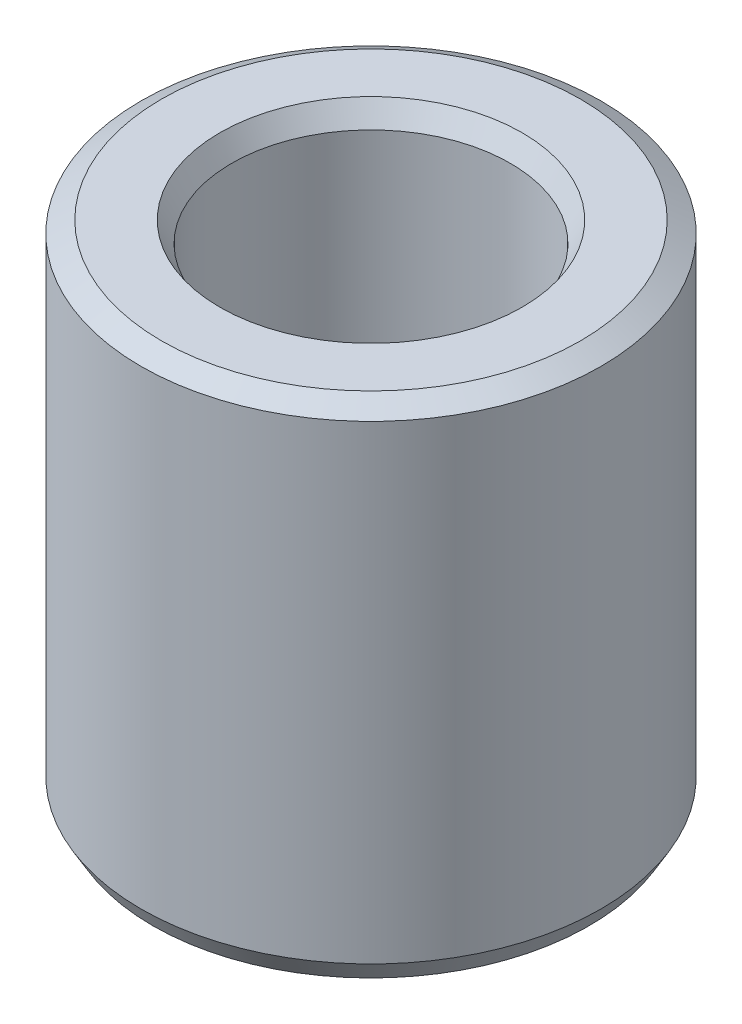
ISO-10303-21;
HEADER;
FILE_DESCRIPTION(('STEP AP214'),'2;1');
FILE_NAME('part.step','',(''),(''),'','','');
FILE_SCHEMA(('AUTOMOTIVE_DESIGN { 1 0 10303 214 1 1 1 1 }'));
ENDSEC;
DATA;
#1=APPLICATION_CONTEXT('core data for automotive mechanical design processes');
#2=APPLICATION_PROTOCOL_DEFINITION('international standard','automotive_design',2000,#1);
#3=PRODUCT_CONTEXT('',#1,'mechanical');
#4=PRODUCT('Part','Part','',(#3));
#5=PRODUCT_RELATED_PRODUCT_CATEGORY('part','',(#4));
#6=PRODUCT_DEFINITION_FORMATION('','',#4);
#7=PRODUCT_DEFINITION_CONTEXT('part definition',#1,'design');
#8=PRODUCT_DEFINITION('design','',#6,#7);
#9=PRODUCT_DEFINITION_SHAPE('','',#8);
#10=(LENGTH_UNIT() NAMED_UNIT(*) SI_UNIT(.MILLI.,.METRE.));
#11=(NAMED_UNIT(*) PLANE_ANGLE_UNIT() SI_UNIT($,.RADIAN.));
#12=(NAMED_UNIT(*) SI_UNIT($,.STERADIAN.) SOLID_ANGLE_UNIT());
#13=UNCERTAINTY_MEASURE_WITH_UNIT(LENGTH_MEASURE(1.E-05),#10,'distance_accuracy_value','');
#14=(GEOMETRIC_REPRESENTATION_CONTEXT(3) GLOBAL_UNCERTAINTY_ASSIGNED_CONTEXT((#13)) GLOBAL_UNIT_ASSIGNED_CONTEXT((#10,
#11,#12)) REPRESENTATION_CONTEXT('',''));
#15=CARTESIAN_POINT('',(0.,0.,0.));
#16=DIRECTION('',(0.,0.,1.));
#17=DIRECTION('',(1.,0.,0.));
#18=AXIS2_PLACEMENT_3D('',#15,#16,#17);
#19=CARTESIAN_POINT('',(0.,38.2201651712459,0.));
#20=DIRECTION('',(0.,-1.,0.));
#21=DIRECTION('',(0.,0.,-1.));
#22=AXIS2_PLACEMENT_3D('',#19,#20,#21);
#23=CYLINDRICAL_SURFACE('',#22,17.5);
#24=CARTESIAN_POINT('',(0.,1.56054105892799,0.));
#25=DIRECTION('',(0.,1.,0.));
#26=DIRECTION('',(0.,0.,1.));
#27=AXIS2_PLACEMENT_3D('',#24,#25,#26);
#28=CIRCLE('',#27,17.5);
#29=CARTESIAN_POINT('',(0.,1.56054105892799,17.5));
#30=VERTEX_POINT('',#29);
#31=EDGE_CURVE('E10',#30,#30,#28,.T.);
#32=ORIENTED_EDGE('',*,*,#31,.T.);
#33=EDGE_LOOP('',(#32));
#34=FACE_BOUND('',#33,.T.);
#35=CARTESIAN_POINT('',(0.,37.3191863707924,0.));
#36=DIRECTION('',(0.,1.,0.));
#37=DIRECTION('',(0.,0.,1.));
#38=AXIS2_PLACEMENT_3D('',#35,#36,#37);
#39=CIRCLE('',#38,17.5);
#40=CARTESIAN_POINT('',(0.,37.3191863707924,17.5));
#41=VERTEX_POINT('',#40);
#42=EDGE_CURVE('E50',#41,#41,#39,.F.);
#43=ORIENTED_EDGE('',*,*,#42,.T.);
#44=EDGE_LOOP('',(#43));
#45=FACE_BOUND('',#44,.T.);
#46=ADVANCED_FACE('F39',(#34,#45),#23,.T.);
#47=CARTESIAN_POINT('',(0.,38.2201651712459,0.));
#48=DIRECTION('',(0.,1.,0.));
#49=DIRECTION('',(0.,0.,1.));
#50=AXIS2_PLACEMENT_3D('',#47,#48,#49);
#51=PLANE('',#50);
#52=CARTESIAN_POINT('',(0.,38.2201651712459,0.));
#53=DIRECTION('',(0.,1.,0.));
#54=DIRECTION('',(0.,0.,1.));
#55=AXIS2_PLACEMENT_3D('',#52,#53,#54);
#56=CIRCLE('',#55,11.5021438282033);
#57=CARTESIAN_POINT('',(0.,38.2201651712459,11.5021438282033));
#58=VERTEX_POINT('',#57);
#59=EDGE_CURVE('E58',#58,#58,#56,.F.);
#60=ORIENTED_EDGE('',*,*,#59,.T.);
#61=EDGE_LOOP('',(#60));
#62=FACE_BOUND('',#61,.T.);
#63=CARTESIAN_POINT('',(0.,38.2201651712459,0.));
#64=DIRECTION('',(0.,1.,0.));
#65=DIRECTION('',(0.,0.,1.));
#66=AXIS2_PLACEMENT_3D('',#63,#64,#65);
#67=CIRCLE('',#66,15.939458941072);
#68=CARTESIAN_POINT('',(0.,38.2201651712459,15.939458941072));
#69=VERTEX_POINT('',#68);
#70=EDGE_CURVE('E61',#69,#69,#67,.T.);
#71=ORIENTED_EDGE('',*,*,#70,.T.);
#72=EDGE_LOOP('',(#71));
#73=FACE_BOUND('',#72,.T.);
#74=ADVANCED_FACE('F88',(#62,#73),#51,.T.);
#75=CARTESIAN_POINT('',(0.,0.,0.));
#76=DIRECTION('',(0.,1.,0.));
#77=DIRECTION('',(0.,0.,1.));
#78=AXIS2_PLACEMENT_3D('',#75,#76,#77);
#79=PLANE('',#78);
#80=CARTESIAN_POINT('',(0.,0.,0.));
#81=DIRECTION('',(0.,1.,0.));
#82=DIRECTION('',(0.,0.,1.));
#83=AXIS2_PLACEMENT_3D('',#80,#81,#82);
#84=CIRCLE('',#83,12.1617060866777);
#85=CARTESIAN_POINT('',(0.,0.,12.1617060866777));
#86=VERTEX_POINT('',#85);
#87=EDGE_CURVE('E51',#86,#86,#84,.T.);
#88=ORIENTED_EDGE('',*,*,#87,.T.);
#89=EDGE_LOOP('',(#88));
#90=FACE_BOUND('',#89,.T.);
#91=CARTESIAN_POINT('',(0.,0.,0.));
#92=DIRECTION('',(0.,1.,0.));
#93=DIRECTION('',(0.,0.,1.));
#94=AXIS2_PLACEMENT_3D('',#91,#92,#93);
#95=CIRCLE('',#94,16.5990211995465);
#96=CARTESIAN_POINT('',(0.,0.,16.5990211995465));
#97=VERTEX_POINT('',#96);
#98=EDGE_CURVE('E54',#97,#97,#95,.F.);
#99=ORIENTED_EDGE('',*,*,#98,.T.);
#100=EDGE_LOOP('',(#99));
#101=FACE_BOUND('',#100,.T.);
#102=ADVANCED_FACE('F83',(#90,#101),#79,.F.);
#103=CARTESIAN_POINT('',(0.,38.2201651712459,0.));
#104=DIRECTION('',(0.,-1.,0.));
#105=DIRECTION('',(0.,0.,-1.));
#106=AXIS2_PLACEMENT_3D('',#103,#104,#105);
#107=CYLINDRICAL_SURFACE('',#106,10.6011650277497);
#108=CARTESIAN_POINT('',(0.,36.6596241123179,0.));
#109=DIRECTION('',(0.,1.,0.));
#110=DIRECTION('',(0.,0.,1.));
#111=AXIS2_PLACEMENT_3D('',#108,#109,#110);
#112=CIRCLE('',#111,10.6011650277497);
#113=CARTESIAN_POINT('',(0.,36.6596241123179,10.6011650277497));
#114=VERTEX_POINT('',#113);
#115=EDGE_CURVE('E67',#114,#114,#112,.T.);
#116=ORIENTED_EDGE('',*,*,#115,.T.);
#117=EDGE_LOOP('',(#116));
#118=FACE_BOUND('',#117,.T.);
#119=CARTESIAN_POINT('',(0.,0.900978800453547,0.));
#120=DIRECTION('',(0.,1.,0.));
#121=DIRECTION('',(0.,0.,1.));
#122=AXIS2_PLACEMENT_3D('',#119,#120,#121);
#123=CIRCLE('',#122,10.6011650277497);
#124=CARTESIAN_POINT('',(0.,0.900978800453547,10.6011650277497));
#125=VERTEX_POINT('',#124);
#126=EDGE_CURVE('E69',#125,#125,#123,.F.);
#127=ORIENTED_EDGE('',*,*,#126,.T.);
#128=EDGE_LOOP('',(#127));
#129=FACE_BOUND('',#128,.T.);
#130=ADVANCED_FACE('F71',(#118,#129),#107,.F.);
#131=CARTESIAN_POINT('',(0.,36.6596241123179,0.));
#132=DIRECTION('',(0.,1.,0.));
#133=DIRECTION('',(0.,0.,1.));
#134=AXIS2_PLACEMENT_3D('',#131,#132,#133);
#135=CONICAL_SURFACE('',#134,10.6011650277497,0.523598775598297);
#136=ORIENTED_EDGE('',*,*,#59,.F.);
#137=EDGE_LOOP('',(#136));
#138=FACE_BOUND('',#137,.T.);
#139=ORIENTED_EDGE('',*,*,#115,.F.);
#140=EDGE_LOOP('',(#139));
#141=FACE_BOUND('',#140,.T.);
#142=ADVANCED_FACE('F77',(#138,#141),#135,.F.);
#143=CARTESIAN_POINT('',(0.,0.,0.));
#144=DIRECTION('',(0.,-1.,0.));
#145=DIRECTION('',(0.,0.,-1.));
#146=AXIS2_PLACEMENT_3D('',#143,#144,#145);
#147=CONICAL_SURFACE('',#146,12.1617060866777,1.04719755119659);
#148=ORIENTED_EDGE('',*,*,#126,.F.);
#149=EDGE_LOOP('',(#148));
#150=FACE_BOUND('',#149,.T.);
#151=ORIENTED_EDGE('',*,*,#87,.F.);
#152=EDGE_LOOP('',(#151));
#153=FACE_BOUND('',#152,.T.);
#154=ADVANCED_FACE('F73',(#150,#153),#147,.F.);
#155=CARTESIAN_POINT('',(0.,1.56054105892799,0.));
#156=DIRECTION('',(0.,1.,0.));
#157=DIRECTION('',(0.,0.,1.));
#158=AXIS2_PLACEMENT_3D('',#155,#156,#157);
#159=CONICAL_SURFACE('',#158,17.5,0.523598775598301);
#160=ORIENTED_EDGE('',*,*,#98,.F.);
#161=EDGE_LOOP('',(#160));
#162=FACE_BOUND('',#161,.T.);
#163=ORIENTED_EDGE('',*,*,#31,.F.);
#164=EDGE_LOOP('',(#163));
#165=FACE_BOUND('',#164,.T.);
#166=ADVANCED_FACE('F76',(#162,#165),#159,.T.);
#167=CARTESIAN_POINT('',(0.,38.2201651712459,0.));
#168=DIRECTION('',(0.,-1.,0.));
#169=DIRECTION('',(0.,0.,-1.));
#170=AXIS2_PLACEMENT_3D('',#167,#168,#169);
#171=CONICAL_SURFACE('',#170,15.939458941072,1.04719755119659);
#172=ORIENTED_EDGE('',*,*,#42,.F.);
#173=EDGE_LOOP('',(#172));
#174=FACE_BOUND('',#173,.T.);
#175=ORIENTED_EDGE('',*,*,#70,.F.);
#176=EDGE_LOOP('',(#175));
#177=FACE_BOUND('',#176,.T.);
#178=ADVANCED_FACE('F45',(#174,#177),#171,.T.);
#179=CLOSED_SHELL('',(#46,#74,#102,#130,#142,#154,#166,#178));
#180=MANIFOLD_SOLID_BREP('B2',#179);
#181=ADVANCED_BREP_SHAPE_REPRESENTATION('',(#18,#180),#14);
#182=SHAPE_DEFINITION_REPRESENTATION(#9,#181);
ENDSEC;
END-ISO-10303-21;
